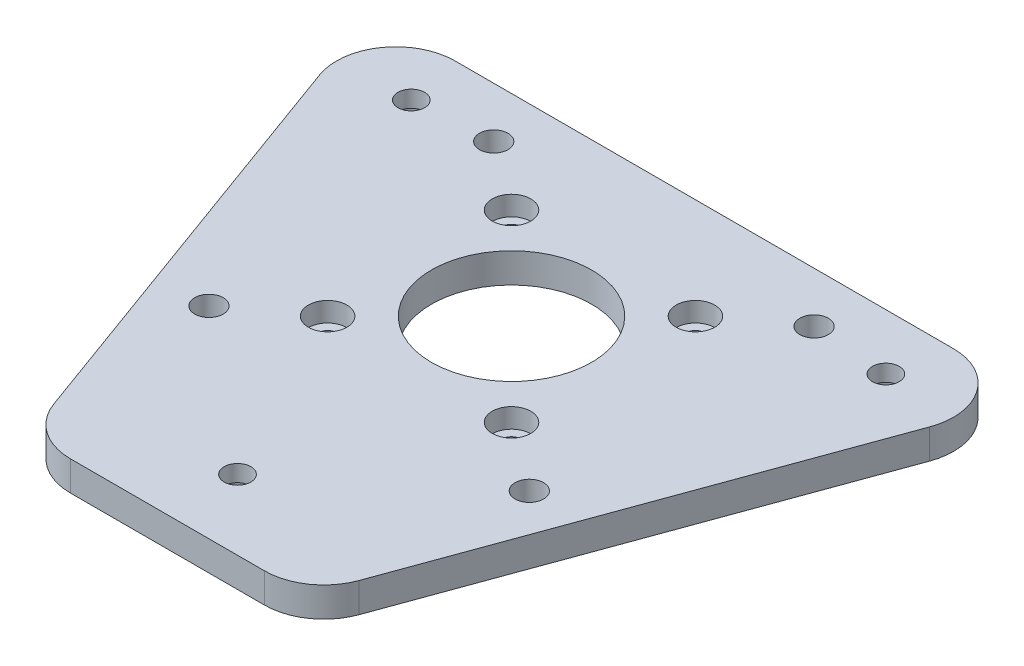
ISO-10303-21;
HEADER;
FILE_DESCRIPTION(('STEP AP214'),'2;1');
FILE_NAME('part.step','',(''),(''),'','','');
FILE_SCHEMA(('AUTOMOTIVE_DESIGN { 1 0 10303 214 1 1 1 1 }'));
ENDSEC;
DATA;
#1=APPLICATION_CONTEXT('core data for automotive mechanical design processes');
#2=APPLICATION_PROTOCOL_DEFINITION('international standard','automotive_design',2000,#1);
#3=PRODUCT_CONTEXT('',#1,'mechanical');
#4=PRODUCT('Part','Part','',(#3));
#5=PRODUCT_RELATED_PRODUCT_CATEGORY('part','',(#4));
#6=PRODUCT_DEFINITION_FORMATION('','',#4);
#7=PRODUCT_DEFINITION_CONTEXT('part definition',#1,'design');
#8=PRODUCT_DEFINITION('design','',#6,#7);
#9=PRODUCT_DEFINITION_SHAPE('','',#8);
#10=(LENGTH_UNIT() NAMED_UNIT(*) SI_UNIT(.MILLI.,.METRE.));
#11=(NAMED_UNIT(*) PLANE_ANGLE_UNIT() SI_UNIT($,.RADIAN.));
#12=(NAMED_UNIT(*) SI_UNIT($,.STERADIAN.) SOLID_ANGLE_UNIT());
#13=UNCERTAINTY_MEASURE_WITH_UNIT(LENGTH_MEASURE(1.E-05),#10,'distance_accuracy_value','');
#14=(GEOMETRIC_REPRESENTATION_CONTEXT(3) GLOBAL_UNCERTAINTY_ASSIGNED_CONTEXT((#13)) GLOBAL_UNIT_ASSIGNED_CONTEXT((#10,
#11,#12)) REPRESENTATION_CONTEXT('',''));
#15=CARTESIAN_POINT('',(0.,0.,0.));
#16=DIRECTION('',(0.,0.,1.));
#17=DIRECTION('',(1.,0.,0.));
#18=AXIS2_PLACEMENT_3D('',#15,#16,#17);
#19=CARTESIAN_POINT('',(0.,5.,0.));
#20=DIRECTION('',(0.,-1.,0.));
#21=DIRECTION('',(0.,0.,-1.));
#22=AXIS2_PLACEMENT_3D('',#19,#20,#21);
#23=PLANE('',#22);
#24=CARTESIAN_POINT('',(0.,5.,46.19));
#25=DIRECTION('',(0.,-1.,0.));
#26=DIRECTION('',(0.,0.,-1.));
#27=AXIS2_PLACEMENT_3D('',#24,#25,#26);
#28=CIRCLE('',#27,2.25);
#29=CARTESIAN_POINT('',(0.,5.,43.94));
#30=VERTEX_POINT('',#29);
#31=EDGE_CURVE('E288',#30,#30,#28,.T.);
#32=ORIENTED_EDGE('',*,*,#31,.T.);
#33=EDGE_LOOP('',(#32));
#34=FACE_BOUND('',#33,.T.);
#35=CARTESIAN_POINT('',(-40.,5.,-23.1));
#36=DIRECTION('',(0.,-1.,0.));
#37=DIRECTION('',(0.,0.,-1.));
#38=AXIS2_PLACEMENT_3D('',#35,#36,#37);
#39=CIRCLE('',#38,2.25);
#40=CARTESIAN_POINT('',(-40.,5.,-25.35));
#41=VERTEX_POINT('',#40);
#42=EDGE_CURVE('E276',#41,#41,#39,.T.);
#43=ORIENTED_EDGE('',*,*,#42,.T.);
#44=EDGE_LOOP('',(#43));
#45=FACE_BOUND('',#44,.T.);
#46=CARTESIAN_POINT('',(40.,5.,-23.1));
#47=DIRECTION('',(0.,-1.,0.));
#48=DIRECTION('',(0.,0.,-1.));
#49=AXIS2_PLACEMENT_3D('',#46,#47,#48);
#50=CIRCLE('',#49,2.25);
#51=CARTESIAN_POINT('',(40.,5.,-25.35));
#52=VERTEX_POINT('',#51);
#53=EDGE_CURVE('E264',#52,#52,#50,.T.);
#54=ORIENTED_EDGE('',*,*,#53,.T.);
#55=EDGE_LOOP('',(#54));
#56=FACE_BOUND('',#55,.T.);
#57=CARTESIAN_POINT('',(-15.5,5.,-15.5));
#58=DIRECTION('',(0.,1.,0.));
#59=DIRECTION('',(0.,0.,1.));
#60=AXIS2_PLACEMENT_3D('',#57,#58,#59);
#61=CIRCLE('',#60,3.25);
#62=CARTESIAN_POINT('',(-15.5,5.,-12.25));
#63=VERTEX_POINT('',#62);
#64=EDGE_CURVE('E261',#63,#63,#61,.T.);
#65=ORIENTED_EDGE('',*,*,#64,.F.);
#66=EDGE_LOOP('',(#65));
#67=FACE_BOUND('',#66,.T.);
#68=CARTESIAN_POINT('',(15.5,5.,-15.5));
#69=DIRECTION('',(0.,1.,0.));
#70=DIRECTION('',(0.,0.,1.));
#71=AXIS2_PLACEMENT_3D('',#68,#69,#70);
#72=CIRCLE('',#71,3.25);
#73=CARTESIAN_POINT('',(15.5,5.,-12.25));
#74=VERTEX_POINT('',#73);
#75=EDGE_CURVE('E249',#74,#74,#72,.T.);
#76=ORIENTED_EDGE('',*,*,#75,.F.);
#77=EDGE_LOOP('',(#76));
#78=FACE_BOUND('',#77,.T.);
#79=CARTESIAN_POINT('',(15.5,5.,15.5));
#80=DIRECTION('',(0.,1.,0.));
#81=DIRECTION('',(0.,0.,1.));
#82=AXIS2_PLACEMENT_3D('',#79,#80,#81);
#83=CIRCLE('',#82,3.25);
#84=CARTESIAN_POINT('',(15.5,5.,18.75));
#85=VERTEX_POINT('',#84);
#86=EDGE_CURVE('E237',#85,#85,#83,.T.);
#87=ORIENTED_EDGE('',*,*,#86,.F.);
#88=EDGE_LOOP('',(#87));
#89=FACE_BOUND('',#88,.T.);
#90=CARTESIAN_POINT('',(-15.5,5.,15.5));
#91=DIRECTION('',(0.,1.,0.));
#92=DIRECTION('',(0.,0.,1.));
#93=AXIS2_PLACEMENT_3D('',#90,#91,#92);
#94=CIRCLE('',#93,3.25);
#95=CARTESIAN_POINT('',(-15.5,5.,18.75));
#96=VERTEX_POINT('',#95);
#97=EDGE_CURVE('E225',#96,#96,#94,.T.);
#98=ORIENTED_EDGE('',*,*,#97,.F.);
#99=EDGE_LOOP('',(#98));
#100=FACE_BOUND('',#99,.T.);
#101=CARTESIAN_POINT('',(0.,5.,0.));
#102=DIRECTION('',(0.,1.,0.));
#103=DIRECTION('',(0.,0.,1.));
#104=AXIS2_PLACEMENT_3D('',#101,#102,#103);
#105=CIRCLE('',#104,13.5);
#106=CARTESIAN_POINT('',(0.,5.,13.5));
#107=VERTEX_POINT('',#106);
#108=EDGE_CURVE('E50',#107,#107,#105,.T.);
#109=ORIENTED_EDGE('',*,*,#108,.F.);
#110=EDGE_LOOP('',(#109));
#111=FACE_BOUND('',#110,.T.);
#112=CARTESIAN_POINT('',(-16.3480951115046,5.,48.));
#113=DIRECTION('',(0.,1.,0.));
#114=DIRECTION('',(0.,0.,1.));
#115=AXIS2_PLACEMENT_3D('',#112,#113,#114);
#116=CIRCLE('',#115,10.);
#117=CARTESIAN_POINT('',(-25.7449430600682,5.,51.4204164412504));
#118=VERTEX_POINT('',#117);
#119=CARTESIAN_POINT('',(-16.3480951115045,5.,58.));
#120=VERTEX_POINT('',#119);
#121=EDGE_CURVE('E147',#118,#120,#116,.T.);
#122=ORIENTED_EDGE('',*,*,#121,.T.);
#123=DIRECTION('',(1.,0.,0.));
#124=VECTOR('',#123,1.);
#125=CARTESIAN_POINT('',(-16.3480951115045,5.,58.));
#126=LINE('',#125,#124);
#127=CARTESIAN_POINT('',(16.3480951115045,5.,58.));
#128=VERTEX_POINT('',#127);
#129=EDGE_CURVE('E150',#120,#128,#126,.T.);
#130=ORIENTED_EDGE('',*,*,#129,.T.);
#131=CARTESIAN_POINT('',(16.3480951115046,5.,48.));
#132=DIRECTION('',(0.,1.,0.));
#133=DIRECTION('',(0.,0.,-1.));
#134=AXIS2_PLACEMENT_3D('',#131,#132,#133);
#135=CIRCLE('',#134,10.);
#136=CARTESIAN_POINT('',(25.7449430600682,5.,51.4204164412504));
#137=VERTEX_POINT('',#136);
#138=EDGE_CURVE('E61',#128,#137,#135,.T.);
#139=ORIENTED_EDGE('',*,*,#138,.T.);
#140=DIRECTION('',(0.342041644125043,0.,-0.939684794856359));
#141=VECTOR('',#140,1.);
#142=CARTESIAN_POINT('',(51.4066713787663,5.,-19.0795835587496));
#143=LINE('',#142,#141);
#144=CARTESIAN_POINT('',(51.4066713787663,5.,-19.0795835587496));
#145=VERTEX_POINT('',#144);
#146=EDGE_CURVE('E118',#137,#145,#143,.T.);
#147=ORIENTED_EDGE('',*,*,#146,.T.);
#148=CARTESIAN_POINT('',(42.0098234302028,5.,-22.5000000000001));
#149=DIRECTION('',(0.,1.,0.));
#150=DIRECTION('',(0.,0.,1.));
#151=AXIS2_PLACEMENT_3D('',#148,#149,#150);
#152=CIRCLE('',#151,10.);
#153=CARTESIAN_POINT('',(42.0098234302027,5.,-32.5000000000001));
#154=VERTEX_POINT('',#153);
#155=EDGE_CURVE('E156',#145,#154,#152,.T.);
#156=ORIENTED_EDGE('',*,*,#155,.T.);
#157=DIRECTION('',(-1.,0.,0.));
#158=VECTOR('',#157,1.);
#159=CARTESIAN_POINT('',(-42.0098234302027,5.,-32.5000000000001));
#160=LINE('',#159,#158);
#161=CARTESIAN_POINT('',(-42.0098234302028,5.,-32.5000000000001));
#162=VERTEX_POINT('',#161);
#163=EDGE_CURVE('E159',#154,#162,#160,.T.);
#164=ORIENTED_EDGE('',*,*,#163,.T.);
#165=CARTESIAN_POINT('',(-42.0098234302028,5.,-22.5000000000001));
#166=DIRECTION('',(0.,1.,0.));
#167=DIRECTION('',(0.,0.,-1.));
#168=AXIS2_PLACEMENT_3D('',#165,#166,#167);
#169=CIRCLE('',#168,10.);
#170=CARTESIAN_POINT('',(-51.4066713787663,5.,-19.0795835587496));
#171=VERTEX_POINT('',#170);
#172=EDGE_CURVE('E162',#162,#171,#169,.T.);
#173=ORIENTED_EDGE('',*,*,#172,.T.);
#174=DIRECTION('',(0.342041644125043,0.,0.939684794856359));
#175=VECTOR('',#174,1.);
#176=CARTESIAN_POINT('',(-51.4066713787663,5.,-19.0795835587496));
#177=LINE('',#176,#175);
#178=EDGE_CURVE('E165',#171,#118,#177,.T.);
#179=ORIENTED_EDGE('',*,*,#178,.T.);
#180=EDGE_LOOP('',(#122,#130,#139,#147,#156,#164,#173,#179));
#181=FACE_BOUND('',#180,.T.);
#182=CARTESIAN_POINT('',(-27.,5.,24.));
#183=DIRECTION('',(0.,1.,0.));
#184=DIRECTION('',(0.,0.,1.));
#185=AXIS2_PLACEMENT_3D('',#182,#183,#184);
#186=CIRCLE('',#185,2.4);
#187=CARTESIAN_POINT('',(-27.,5.,26.4));
#188=VERTEX_POINT('',#187);
#189=EDGE_CURVE('E195',#188,#188,#186,.T.);
#190=ORIENTED_EDGE('',*,*,#189,.F.);
#191=EDGE_LOOP('',(#190));
#192=FACE_BOUND('',#191,.T.);
#193=CARTESIAN_POINT('',(27.,5.,24.));
#194=DIRECTION('',(0.,1.,0.));
#195=DIRECTION('',(0.,0.,1.));
#196=AXIS2_PLACEMENT_3D('',#193,#194,#195);
#197=CIRCLE('',#196,2.4);
#198=CARTESIAN_POINT('',(27.,5.,26.4));
#199=VERTEX_POINT('',#198);
#200=EDGE_CURVE('E201',#199,#199,#197,.T.);
#201=ORIENTED_EDGE('',*,*,#200,.F.);
#202=EDGE_LOOP('',(#201));
#203=FACE_BOUND('',#202,.T.);
#204=CARTESIAN_POINT('',(27.,5.,-24.0000000000001));
#205=DIRECTION('',(0.,1.,0.));
#206=DIRECTION('',(0.,0.,1.));
#207=AXIS2_PLACEMENT_3D('',#204,#205,#206);
#208=CIRCLE('',#207,2.4);
#209=CARTESIAN_POINT('',(27.,5.,-21.6000000000001));
#210=VERTEX_POINT('',#209);
#211=EDGE_CURVE('E207',#210,#210,#208,.T.);
#212=ORIENTED_EDGE('',*,*,#211,.F.);
#213=EDGE_LOOP('',(#212));
#214=FACE_BOUND('',#213,.T.);
#215=CARTESIAN_POINT('',(-27.,5.,-24.0000000000001));
#216=DIRECTION('',(0.,1.,0.));
#217=DIRECTION('',(0.,0.,1.));
#218=AXIS2_PLACEMENT_3D('',#215,#216,#217);
#219=CIRCLE('',#218,2.4);
#220=CARTESIAN_POINT('',(-27.,5.,-21.6000000000001));
#221=VERTEX_POINT('',#220);
#222=EDGE_CURVE('E213',#221,#221,#219,.T.);
#223=ORIENTED_EDGE('',*,*,#222,.F.);
#224=EDGE_LOOP('',(#223));
#225=FACE_BOUND('',#224,.T.);
#226=ADVANCED_FACE('F46',(#34,#45,#56,#67,#78,#89,#100,#111,#181,#192,#203,#214,#225),#23,.F.);
#227=CARTESIAN_POINT('',(0.,0.,0.));
#228=DIRECTION('',(0.,-1.,0.));
#229=DIRECTION('',(0.,0.,-1.));
#230=AXIS2_PLACEMENT_3D('',#227,#228,#229);
#231=PLANE('',#230);
#232=CARTESIAN_POINT('',(0.,0.,46.19));
#233=DIRECTION('',(0.,-1.,0.));
#234=DIRECTION('',(0.,0.,-1.));
#235=AXIS2_PLACEMENT_3D('',#232,#233,#234);
#236=CIRCLE('',#235,4.3);
#237=CARTESIAN_POINT('',(0.,0.,41.89));
#238=VERTEX_POINT('',#237);
#239=EDGE_CURVE('E297',#238,#238,#236,.T.);
#240=ORIENTED_EDGE('',*,*,#239,.F.);
#241=EDGE_LOOP('',(#240));
#242=FACE_BOUND('',#241,.T.);
#243=CARTESIAN_POINT('',(-40.,0.,-23.1));
#244=DIRECTION('',(0.,-1.,0.));
#245=DIRECTION('',(0.,0.,-1.));
#246=AXIS2_PLACEMENT_3D('',#243,#244,#245);
#247=CIRCLE('',#246,4.3);
#248=CARTESIAN_POINT('',(-40.,0.,-27.4));
#249=VERTEX_POINT('',#248);
#250=EDGE_CURVE('E285',#249,#249,#247,.T.);
#251=ORIENTED_EDGE('',*,*,#250,.F.);
#252=EDGE_LOOP('',(#251));
#253=FACE_BOUND('',#252,.T.);
#254=CARTESIAN_POINT('',(40.,0.,-23.1));
#255=DIRECTION('',(0.,-1.,0.));
#256=DIRECTION('',(0.,0.,-1.));
#257=AXIS2_PLACEMENT_3D('',#254,#255,#256);
#258=CIRCLE('',#257,4.3);
#259=CARTESIAN_POINT('',(40.,0.,-27.4));
#260=VERTEX_POINT('',#259);
#261=EDGE_CURVE('E273',#260,#260,#258,.T.);
#262=ORIENTED_EDGE('',*,*,#261,.F.);
#263=EDGE_LOOP('',(#262));
#264=FACE_BOUND('',#263,.T.);
#265=CARTESIAN_POINT('',(-15.5,0.,-15.5));
#266=DIRECTION('',(0.,-1.,0.));
#267=DIRECTION('',(0.,0.,-1.));
#268=AXIS2_PLACEMENT_3D('',#265,#266,#267);
#269=CIRCLE('',#268,1.7);
#270=CARTESIAN_POINT('',(-15.5,0.,-17.2));
#271=VERTEX_POINT('',#270);
#272=EDGE_CURVE('E252',#271,#271,#269,.T.);
#273=ORIENTED_EDGE('',*,*,#272,.F.);
#274=EDGE_LOOP('',(#273));
#275=FACE_BOUND('',#274,.T.);
#276=CARTESIAN_POINT('',(15.5,0.,-15.5));
#277=DIRECTION('',(0.,-1.,0.));
#278=DIRECTION('',(0.,0.,-1.));
#279=AXIS2_PLACEMENT_3D('',#276,#277,#278);
#280=CIRCLE('',#279,1.7);
#281=CARTESIAN_POINT('',(15.5,0.,-17.2));
#282=VERTEX_POINT('',#281);
#283=EDGE_CURVE('E240',#282,#282,#280,.T.);
#284=ORIENTED_EDGE('',*,*,#283,.F.);
#285=EDGE_LOOP('',(#284));
#286=FACE_BOUND('',#285,.T.);
#287=CARTESIAN_POINT('',(15.5,0.,15.5));
#288=DIRECTION('',(0.,-1.,0.));
#289=DIRECTION('',(0.,0.,-1.));
#290=AXIS2_PLACEMENT_3D('',#287,#288,#289);
#291=CIRCLE('',#290,1.7);
#292=CARTESIAN_POINT('',(15.5,0.,13.8));
#293=VERTEX_POINT('',#292);
#294=EDGE_CURVE('E228',#293,#293,#291,.T.);
#295=ORIENTED_EDGE('',*,*,#294,.F.);
#296=EDGE_LOOP('',(#295));
#297=FACE_BOUND('',#296,.T.);
#298=CARTESIAN_POINT('',(-15.5,0.,15.5));
#299=DIRECTION('',(0.,-1.,0.));
#300=DIRECTION('',(0.,0.,-1.));
#301=AXIS2_PLACEMENT_3D('',#298,#299,#300);
#302=CIRCLE('',#301,1.7);
#303=CARTESIAN_POINT('',(-15.5,0.,13.8));
#304=VERTEX_POINT('',#303);
#305=EDGE_CURVE('E216',#304,#304,#302,.T.);
#306=ORIENTED_EDGE('',*,*,#305,.F.);
#307=EDGE_LOOP('',(#306));
#308=FACE_BOUND('',#307,.T.);
#309=CARTESIAN_POINT('',(-27.,0.,-24.0000000000001));
#310=DIRECTION('',(0.,-1.,0.));
#311=DIRECTION('',(0.,0.,-1.));
#312=AXIS2_PLACEMENT_3D('',#309,#310,#311);
#313=CIRCLE('',#312,2.4);
#314=CARTESIAN_POINT('',(-27.,0.,-26.4000000000001));
#315=VERTEX_POINT('',#314);
#316=EDGE_CURVE('E210',#315,#315,#313,.T.);
#317=ORIENTED_EDGE('',*,*,#316,.F.);
#318=EDGE_LOOP('',(#317));
#319=FACE_BOUND('',#318,.T.);
#320=CARTESIAN_POINT('',(27.,0.,-24.0000000000001));
#321=DIRECTION('',(0.,-1.,0.));
#322=DIRECTION('',(0.,0.,-1.));
#323=AXIS2_PLACEMENT_3D('',#320,#321,#322);
#324=CIRCLE('',#323,2.4);
#325=CARTESIAN_POINT('',(27.,0.,-26.4000000000001));
#326=VERTEX_POINT('',#325);
#327=EDGE_CURVE('E204',#326,#326,#324,.T.);
#328=ORIENTED_EDGE('',*,*,#327,.F.);
#329=EDGE_LOOP('',(#328));
#330=FACE_BOUND('',#329,.T.);
#331=CARTESIAN_POINT('',(27.,0.,24.));
#332=DIRECTION('',(0.,-1.,0.));
#333=DIRECTION('',(0.,0.,-1.));
#334=AXIS2_PLACEMENT_3D('',#331,#332,#333);
#335=CIRCLE('',#334,2.4);
#336=CARTESIAN_POINT('',(27.,0.,21.6));
#337=VERTEX_POINT('',#336);
#338=EDGE_CURVE('E198',#337,#337,#335,.T.);
#339=ORIENTED_EDGE('',*,*,#338,.F.);
#340=EDGE_LOOP('',(#339));
#341=FACE_BOUND('',#340,.T.);
#342=CARTESIAN_POINT('',(-27.,0.,24.));
#343=DIRECTION('',(0.,-1.,0.));
#344=DIRECTION('',(0.,0.,-1.));
#345=AXIS2_PLACEMENT_3D('',#342,#343,#344);
#346=CIRCLE('',#345,2.4);
#347=CARTESIAN_POINT('',(-27.,0.,21.6));
#348=VERTEX_POINT('',#347);
#349=EDGE_CURVE('E151',#348,#348,#346,.T.);
#350=ORIENTED_EDGE('',*,*,#349,.F.);
#351=EDGE_LOOP('',(#350));
#352=FACE_BOUND('',#351,.T.);
#353=CARTESIAN_POINT('',(0.,0.,0.));
#354=DIRECTION('',(0.,1.,0.));
#355=DIRECTION('',(0.,0.,1.));
#356=AXIS2_PLACEMENT_3D('',#353,#354,#355);
#357=CIRCLE('',#356,13.5);
#358=CARTESIAN_POINT('',(0.,0.,13.5));
#359=VERTEX_POINT('',#358);
#360=EDGE_CURVE('E13',#359,#359,#357,.T.);
#361=ORIENTED_EDGE('',*,*,#360,.T.);
#362=EDGE_LOOP('',(#361));
#363=FACE_BOUND('',#362,.T.);
#364=DIRECTION('',(1.,0.,0.));
#365=VECTOR('',#364,1.);
#366=CARTESIAN_POINT('',(-16.3480951115045,0.,58.));
#367=LINE('',#366,#365);
#368=CARTESIAN_POINT('',(-16.3480951115045,0.,58.));
#369=VERTEX_POINT('',#368);
#370=CARTESIAN_POINT('',(16.3480951115045,0.,58.));
#371=VERTEX_POINT('',#370);
#372=EDGE_CURVE('E128',#369,#371,#367,.T.);
#373=ORIENTED_EDGE('',*,*,#372,.F.);
#374=CARTESIAN_POINT('',(-16.3480951115046,0.,48.));
#375=DIRECTION('',(0.,1.,0.));
#376=DIRECTION('',(0.,0.,1.));
#377=AXIS2_PLACEMENT_3D('',#374,#375,#376);
#378=CIRCLE('',#377,10.);
#379=CARTESIAN_POINT('',(-25.7449430600682,0.,51.4204164412504));
#380=VERTEX_POINT('',#379);
#381=EDGE_CURVE('E69',#380,#369,#378,.T.);
#382=ORIENTED_EDGE('',*,*,#381,.F.);
#383=DIRECTION('',(0.342041644125043,0.,0.939684794856359));
#384=VECTOR('',#383,1.);
#385=CARTESIAN_POINT('',(-51.4066713787663,0.,-19.0795835587496));
#386=LINE('',#385,#384);
#387=CARTESIAN_POINT('',(-51.4066713787663,0.,-19.0795835587496));
#388=VERTEX_POINT('',#387);
#389=EDGE_CURVE('E143',#388,#380,#386,.T.);
#390=ORIENTED_EDGE('',*,*,#389,.F.);
#391=CARTESIAN_POINT('',(-42.0098234302028,0.,-22.5000000000001));
#392=DIRECTION('',(0.,1.,0.));
#393=DIRECTION('',(0.,0.,-1.));
#394=AXIS2_PLACEMENT_3D('',#391,#392,#393);
#395=CIRCLE('',#394,10.);
#396=CARTESIAN_POINT('',(-42.0098234302028,0.,-32.5000000000001));
#397=VERTEX_POINT('',#396);
#398=EDGE_CURVE('E140',#397,#388,#395,.T.);
#399=ORIENTED_EDGE('',*,*,#398,.F.);
#400=DIRECTION('',(-1.,0.,0.));
#401=VECTOR('',#400,1.);
#402=CARTESIAN_POINT('',(-42.0098234302027,0.,-32.5000000000001));
#403=LINE('',#402,#401);
#404=CARTESIAN_POINT('',(42.0098234302027,0.,-32.5000000000001));
#405=VERTEX_POINT('',#404);
#406=EDGE_CURVE('E134',#405,#397,#403,.T.);
#407=ORIENTED_EDGE('',*,*,#406,.F.);
#408=CARTESIAN_POINT('',(42.0098234302028,0.,-22.5000000000001));
#409=DIRECTION('',(0.,1.,0.));
#410=DIRECTION('',(0.,0.,1.));
#411=AXIS2_PLACEMENT_3D('',#408,#409,#410);
#412=CIRCLE('',#411,10.);
#413=CARTESIAN_POINT('',(51.4066713787663,0.,-19.0795835587496));
#414=VERTEX_POINT('',#413);
#415=EDGE_CURVE('E132',#414,#405,#412,.T.);
#416=ORIENTED_EDGE('',*,*,#415,.F.);
#417=DIRECTION('',(0.342041644125043,0.,-0.939684794856359));
#418=VECTOR('',#417,1.);
#419=CARTESIAN_POINT('',(51.4066713787663,0.,-19.0795835587496));
#420=LINE('',#419,#418);
#421=CARTESIAN_POINT('',(25.7449430600682,0.,51.4204164412504));
#422=VERTEX_POINT('',#421);
#423=EDGE_CURVE('E115',#422,#414,#420,.T.);
#424=ORIENTED_EDGE('',*,*,#423,.F.);
#425=CARTESIAN_POINT('',(16.3480951115046,0.,48.));
#426=DIRECTION('',(0.,1.,0.));
#427=DIRECTION('',(0.,0.,-1.));
#428=AXIS2_PLACEMENT_3D('',#425,#426,#427);
#429=CIRCLE('',#428,10.);
#430=EDGE_CURVE('E123',#371,#422,#429,.T.);
#431=ORIENTED_EDGE('',*,*,#430,.F.);
#432=EDGE_LOOP('',(#373,#382,#390,#399,#407,#416,#424,#431));
#433=FACE_BOUND('',#432,.T.);
#434=ADVANCED_FACE('F48',(#242,#253,#264,#275,#286,#297,#308,#319,#330,#341,#352,#363,#433),
#231,.T.);
#435=CARTESIAN_POINT('',(0.,0.,0.));
#436=DIRECTION('',(0.,1.,0.));
#437=DIRECTION('',(0.,0.,1.));
#438=AXIS2_PLACEMENT_3D('',#435,#436,#437);
#439=CYLINDRICAL_SURFACE('',#438,13.5);
#440=ORIENTED_EDGE('',*,*,#360,.F.);
#441=EDGE_LOOP('',(#440));
#442=FACE_BOUND('',#441,.T.);
#443=ORIENTED_EDGE('',*,*,#108,.T.);
#444=EDGE_LOOP('',(#443));
#445=FACE_BOUND('',#444,.T.);
#446=ADVANCED_FACE('F305',(#442,#445),#439,.F.);
#447=CARTESIAN_POINT('',(-16.3480951115046,0.,48.));
#448=DIRECTION('',(0.,1.,0.));
#449=DIRECTION('',(0.,0.,1.));
#450=AXIS2_PLACEMENT_3D('',#447,#448,#449);
#451=CYLINDRICAL_SURFACE('',#450,10.);
#452=ORIENTED_EDGE('',*,*,#121,.F.);
#453=DIRECTION('',(0.,1.,0.));
#454=VECTOR('',#453,1.);
#455=CARTESIAN_POINT('',(-25.7449430600682,0.,51.4204164412504));
#456=LINE('',#455,#454);
#457=EDGE_CURVE('E168',#380,#118,#456,.T.);
#458=ORIENTED_EDGE('',*,*,#457,.F.);
#459=ORIENTED_EDGE('',*,*,#381,.T.);
#460=DIRECTION('',(0.,1.,0.));
#461=VECTOR('',#460,1.);
#462=CARTESIAN_POINT('',(-16.3480951115045,0.,58.));
#463=LINE('',#462,#461);
#464=EDGE_CURVE('E146',#369,#120,#463,.T.);
#465=ORIENTED_EDGE('',*,*,#464,.T.);
#466=EDGE_LOOP('',(#452,#458,#459,#465));
#467=FACE_BOUND('',#466,.T.);
#468=ADVANCED_FACE('F180',(#467),#451,.T.);
#469=CARTESIAN_POINT('',(-51.4066713787663,0.,-19.0795835587496));
#470=DIRECTION('',(-0.939684794856359,0.,0.342041644125043));
#471=DIRECTION('',(0.342041644125043,0.,0.939684794856359));
#472=AXIS2_PLACEMENT_3D('',#469,#470,#471);
#473=PLANE('',#472);
#474=ORIENTED_EDGE('',*,*,#178,.F.);
#475=DIRECTION('',(0.,1.,0.));
#476=VECTOR('',#475,1.);
#477=CARTESIAN_POINT('',(-51.4066713787663,0.,-19.0795835587496));
#478=LINE('',#477,#476);
#479=EDGE_CURVE('E170',#388,#171,#478,.T.);
#480=ORIENTED_EDGE('',*,*,#479,.F.);
#481=ORIENTED_EDGE('',*,*,#389,.T.);
#482=ORIENTED_EDGE('',*,*,#457,.T.);
#483=EDGE_LOOP('',(#474,#480,#481,#482));
#484=FACE_BOUND('',#483,.T.);
#485=ADVANCED_FACE('F188',(#484),#473,.T.);
#486=CARTESIAN_POINT('',(-42.0098234302028,0.,-22.5000000000001));
#487=DIRECTION('',(0.,1.,0.));
#488=DIRECTION('',(0.,0.,1.));
#489=AXIS2_PLACEMENT_3D('',#486,#487,#488);
#490=CYLINDRICAL_SURFACE('',#489,10.);
#491=ORIENTED_EDGE('',*,*,#172,.F.);
#492=DIRECTION('',(0.,1.,0.));
#493=VECTOR('',#492,1.);
#494=CARTESIAN_POINT('',(-42.0098234302028,0.,-32.5000000000001));
#495=LINE('',#494,#493);
#496=EDGE_CURVE('E172',#397,#162,#495,.T.);
#497=ORIENTED_EDGE('',*,*,#496,.F.);
#498=ORIENTED_EDGE('',*,*,#398,.T.);
#499=ORIENTED_EDGE('',*,*,#479,.T.);
#500=EDGE_LOOP('',(#491,#497,#498,#499));
#501=FACE_BOUND('',#500,.T.);
#502=ADVANCED_FACE('F356',(#501),#490,.T.);
#503=CARTESIAN_POINT('',(-42.0098234302027,0.,-32.5000000000001));
#504=DIRECTION('',(0.,0.,-1.));
#505=DIRECTION('',(-1.,0.,0.));
#506=AXIS2_PLACEMENT_3D('',#503,#504,#505);
#507=PLANE('',#506);
#508=ORIENTED_EDGE('',*,*,#163,.F.);
#509=DIRECTION('',(0.,1.,0.));
#510=VECTOR('',#509,1.);
#511=CARTESIAN_POINT('',(42.0098234302027,0.,-32.5000000000001));
#512=LINE('',#511,#510);
#513=EDGE_CURVE('E174',#405,#154,#512,.T.);
#514=ORIENTED_EDGE('',*,*,#513,.F.);
#515=ORIENTED_EDGE('',*,*,#406,.T.);
#516=ORIENTED_EDGE('',*,*,#496,.T.);
#517=EDGE_LOOP('',(#508,#514,#515,#516));
#518=FACE_BOUND('',#517,.T.);
#519=ADVANCED_FACE('F352',(#518),#507,.T.);
#520=CARTESIAN_POINT('',(42.0098234302028,0.,-22.5000000000001));
#521=DIRECTION('',(0.,1.,0.));
#522=DIRECTION('',(0.,0.,1.));
#523=AXIS2_PLACEMENT_3D('',#520,#521,#522);
#524=CYLINDRICAL_SURFACE('',#523,10.);
#525=ORIENTED_EDGE('',*,*,#155,.F.);
#526=DIRECTION('',(0.,1.,0.));
#527=VECTOR('',#526,1.);
#528=CARTESIAN_POINT('',(51.4066713787663,0.,-19.0795835587496));
#529=LINE('',#528,#527);
#530=EDGE_CURVE('E119',#414,#145,#529,.T.);
#531=ORIENTED_EDGE('',*,*,#530,.F.);
#532=ORIENTED_EDGE('',*,*,#415,.T.);
#533=ORIENTED_EDGE('',*,*,#513,.T.);
#534=EDGE_LOOP('',(#525,#531,#532,#533));
#535=FACE_BOUND('',#534,.T.);
#536=ADVANCED_FACE('F349',(#535),#524,.T.);
#537=CARTESIAN_POINT('',(51.4066713787663,0.,-19.0795835587496));
#538=DIRECTION('',(0.939684794856359,0.,0.342041644125043));
#539=DIRECTION('',(0.342041644125043,0.,-0.939684794856359));
#540=AXIS2_PLACEMENT_3D('',#537,#538,#539);
#541=PLANE('',#540);
#542=ORIENTED_EDGE('',*,*,#146,.F.);
#543=DIRECTION('',(0.,1.,0.));
#544=VECTOR('',#543,1.);
#545=CARTESIAN_POINT('',(25.7449430600682,0.,51.4204164412504));
#546=LINE('',#545,#544);
#547=EDGE_CURVE('E111',#422,#137,#546,.T.);
#548=ORIENTED_EDGE('',*,*,#547,.F.);
#549=ORIENTED_EDGE('',*,*,#423,.T.);
#550=ORIENTED_EDGE('',*,*,#530,.T.);
#551=EDGE_LOOP('',(#542,#548,#549,#550));
#552=FACE_BOUND('',#551,.T.);
#553=ADVANCED_FACE('F113',(#552),#541,.T.);
#554=CARTESIAN_POINT('',(16.3480951115046,0.,48.));
#555=DIRECTION('',(0.,1.,0.));
#556=DIRECTION('',(0.,0.,1.));
#557=AXIS2_PLACEMENT_3D('',#554,#555,#556);
#558=CYLINDRICAL_SURFACE('',#557,10.);
#559=ORIENTED_EDGE('',*,*,#138,.F.);
#560=DIRECTION('',(0.,1.,0.));
#561=VECTOR('',#560,1.);
#562=CARTESIAN_POINT('',(16.3480951115045,0.,58.));
#563=LINE('',#562,#561);
#564=EDGE_CURVE('E120',#371,#128,#563,.T.);
#565=ORIENTED_EDGE('',*,*,#564,.F.);
#566=ORIENTED_EDGE('',*,*,#430,.T.);
#567=ORIENTED_EDGE('',*,*,#547,.T.);
#568=EDGE_LOOP('',(#559,#565,#566,#567));
#569=FACE_BOUND('',#568,.T.);
#570=ADVANCED_FACE('F124',(#569),#558,.T.);
#571=CARTESIAN_POINT('',(-16.3480951115045,0.,58.));
#572=DIRECTION('',(0.,0.,1.));
#573=DIRECTION('',(1.,0.,0.));
#574=AXIS2_PLACEMENT_3D('',#571,#572,#573);
#575=PLANE('',#574);
#576=ORIENTED_EDGE('',*,*,#129,.F.);
#577=ORIENTED_EDGE('',*,*,#464,.F.);
#578=ORIENTED_EDGE('',*,*,#372,.T.);
#579=ORIENTED_EDGE('',*,*,#564,.T.);
#580=EDGE_LOOP('',(#576,#577,#578,#579));
#581=FACE_BOUND('',#580,.T.);
#582=ADVANCED_FACE('F182',(#581),#575,.T.);
#583=CARTESIAN_POINT('',(-27.,5.,24.));
#584=DIRECTION('',(0.,1.,0.));
#585=DIRECTION('',(0.,0.,1.));
#586=AXIS2_PLACEMENT_3D('',#583,#584,#585);
#587=CYLINDRICAL_SURFACE('',#586,2.4);
#588=ORIENTED_EDGE('',*,*,#189,.T.);
#589=EDGE_LOOP('',(#588));
#590=FACE_BOUND('',#589,.T.);
#591=ORIENTED_EDGE('',*,*,#349,.T.);
#592=EDGE_LOOP('',(#591));
#593=FACE_BOUND('',#592,.T.);
#594=ADVANCED_FACE('F344',(#590,#593),#587,.F.);
#595=CARTESIAN_POINT('',(27.,5.,24.));
#596=DIRECTION('',(0.,1.,0.));
#597=DIRECTION('',(0.,0.,1.));
#598=AXIS2_PLACEMENT_3D('',#595,#596,#597);
#599=CYLINDRICAL_SURFACE('',#598,2.4);
#600=ORIENTED_EDGE('',*,*,#200,.T.);
#601=EDGE_LOOP('',(#600));
#602=FACE_BOUND('',#601,.T.);
#603=ORIENTED_EDGE('',*,*,#338,.T.);
#604=EDGE_LOOP('',(#603));
#605=FACE_BOUND('',#604,.T.);
#606=ADVANCED_FACE('F365',(#602,#605),#599,.F.);
#607=CARTESIAN_POINT('',(27.,5.,-24.0000000000001));
#608=DIRECTION('',(0.,1.,0.));
#609=DIRECTION('',(0.,0.,1.));
#610=AXIS2_PLACEMENT_3D('',#607,#608,#609);
#611=CYLINDRICAL_SURFACE('',#610,2.4);
#612=ORIENTED_EDGE('',*,*,#211,.T.);
#613=EDGE_LOOP('',(#612));
#614=FACE_BOUND('',#613,.T.);
#615=ORIENTED_EDGE('',*,*,#327,.T.);
#616=EDGE_LOOP('',(#615));
#617=FACE_BOUND('',#616,.T.);
#618=ADVANCED_FACE('F369',(#614,#617),#611,.F.);
#619=CARTESIAN_POINT('',(-27.,5.,-24.0000000000001));
#620=DIRECTION('',(0.,1.,0.));
#621=DIRECTION('',(0.,0.,1.));
#622=AXIS2_PLACEMENT_3D('',#619,#620,#621);
#623=CYLINDRICAL_SURFACE('',#622,2.4);
#624=ORIENTED_EDGE('',*,*,#222,.T.);
#625=EDGE_LOOP('',(#624));
#626=FACE_BOUND('',#625,.T.);
#627=ORIENTED_EDGE('',*,*,#316,.T.);
#628=EDGE_LOOP('',(#627));
#629=FACE_BOUND('',#628,.T.);
#630=ADVANCED_FACE('F373',(#626,#629),#623,.F.);
#631=CARTESIAN_POINT('',(-15.5,5.,15.5));
#632=DIRECTION('',(0.,1.,0.));
#633=DIRECTION('',(0.,0.,1.));
#634=AXIS2_PLACEMENT_3D('',#631,#632,#633);
#635=CYLINDRICAL_SURFACE('',#634,1.7);
#636=CARTESIAN_POINT('',(-15.5,1.7,15.5));
#637=DIRECTION('',(0.,1.,0.));
#638=DIRECTION('',(0.,0.,1.));
#639=AXIS2_PLACEMENT_3D('',#636,#637,#638);
#640=CIRCLE('',#639,1.7);
#641=CARTESIAN_POINT('',(-15.5,1.7,17.2));
#642=VERTEX_POINT('',#641);
#643=EDGE_CURVE('E219',#642,#642,#640,.T.);
#644=ORIENTED_EDGE('',*,*,#643,.T.);
#645=EDGE_LOOP('',(#644));
#646=FACE_BOUND('',#645,.T.);
#647=ORIENTED_EDGE('',*,*,#305,.T.);
#648=EDGE_LOOP('',(#647));
#649=FACE_BOUND('',#648,.T.);
#650=ADVANCED_FACE('F377',(#646,#649),#635,.F.);
#651=CARTESIAN_POINT('',(-13.8,1.7,15.5));
#652=DIRECTION('',(0.,-1.,0.));
#653=DIRECTION('',(0.,0.,-1.));
#654=AXIS2_PLACEMENT_3D('',#651,#652,#653);
#655=PLANE('',#654);
#656=ORIENTED_EDGE('',*,*,#643,.F.);
#657=EDGE_LOOP('',(#656));
#658=FACE_BOUND('',#657,.T.);
#659=CARTESIAN_POINT('',(-15.5,1.7,15.5));
#660=DIRECTION('',(0.,1.,0.));
#661=DIRECTION('',(0.,0.,1.));
#662=AXIS2_PLACEMENT_3D('',#659,#660,#661);
#663=CIRCLE('',#662,3.25);
#664=CARTESIAN_POINT('',(-15.5,1.7,18.75));
#665=VERTEX_POINT('',#664);
#666=EDGE_CURVE('E222',#665,#665,#663,.T.);
#667=ORIENTED_EDGE('',*,*,#666,.T.);
#668=EDGE_LOOP('',(#667));
#669=FACE_BOUND('',#668,.T.);
#670=ADVANCED_FACE('F381',(#658,#669),#655,.F.);
#671=CARTESIAN_POINT('',(-15.5,5.,15.5));
#672=DIRECTION('',(0.,1.,0.));
#673=DIRECTION('',(0.,0.,1.));
#674=AXIS2_PLACEMENT_3D('',#671,#672,#673);
#675=CYLINDRICAL_SURFACE('',#674,3.25);
#676=ORIENTED_EDGE('',*,*,#666,.F.);
#677=EDGE_LOOP('',(#676));
#678=FACE_BOUND('',#677,.T.);
#679=ORIENTED_EDGE('',*,*,#97,.T.);
#680=EDGE_LOOP('',(#679));
#681=FACE_BOUND('',#680,.T.);
#682=ADVANCED_FACE('F385',(#678,#681),#675,.F.);
#683=CARTESIAN_POINT('',(15.5,5.,15.5));
#684=DIRECTION('',(0.,1.,0.));
#685=DIRECTION('',(0.,0.,1.));
#686=AXIS2_PLACEMENT_3D('',#683,#684,#685);
#687=CYLINDRICAL_SURFACE('',#686,1.7);
#688=CARTESIAN_POINT('',(15.5,1.7,15.5));
#689=DIRECTION('',(0.,1.,0.));
#690=DIRECTION('',(0.,0.,1.));
#691=AXIS2_PLACEMENT_3D('',#688,#689,#690);
#692=CIRCLE('',#691,1.7);
#693=CARTESIAN_POINT('',(15.5,1.7,17.2));
#694=VERTEX_POINT('',#693);
#695=EDGE_CURVE('E231',#694,#694,#692,.T.);
#696=ORIENTED_EDGE('',*,*,#695,.T.);
#697=EDGE_LOOP('',(#696));
#698=FACE_BOUND('',#697,.T.);
#699=ORIENTED_EDGE('',*,*,#294,.T.);
#700=EDGE_LOOP('',(#699));
#701=FACE_BOUND('',#700,.T.);
#702=ADVANCED_FACE('F389',(#698,#701),#687,.F.);
#703=CARTESIAN_POINT('',(17.2,1.7,15.5));
#704=DIRECTION('',(0.,-1.,0.));
#705=DIRECTION('',(0.,0.,-1.));
#706=AXIS2_PLACEMENT_3D('',#703,#704,#705);
#707=PLANE('',#706);
#708=ORIENTED_EDGE('',*,*,#695,.F.);
#709=EDGE_LOOP('',(#708));
#710=FACE_BOUND('',#709,.T.);
#711=CARTESIAN_POINT('',(15.5,1.7,15.5));
#712=DIRECTION('',(0.,1.,0.));
#713=DIRECTION('',(0.,0.,1.));
#714=AXIS2_PLACEMENT_3D('',#711,#712,#713);
#715=CIRCLE('',#714,3.25);
#716=CARTESIAN_POINT('',(15.5,1.7,18.75));
#717=VERTEX_POINT('',#716);
#718=EDGE_CURVE('E234',#717,#717,#715,.T.);
#719=ORIENTED_EDGE('',*,*,#718,.T.);
#720=EDGE_LOOP('',(#719));
#721=FACE_BOUND('',#720,.T.);
#722=ADVANCED_FACE('F393',(#710,#721),#707,.F.);
#723=CARTESIAN_POINT('',(15.5,5.,15.5));
#724=DIRECTION('',(0.,1.,0.));
#725=DIRECTION('',(0.,0.,1.));
#726=AXIS2_PLACEMENT_3D('',#723,#724,#725);
#727=CYLINDRICAL_SURFACE('',#726,3.25);
#728=ORIENTED_EDGE('',*,*,#718,.F.);
#729=EDGE_LOOP('',(#728));
#730=FACE_BOUND('',#729,.T.);
#731=ORIENTED_EDGE('',*,*,#86,.T.);
#732=EDGE_LOOP('',(#731));
#733=FACE_BOUND('',#732,.T.);
#734=ADVANCED_FACE('F397',(#730,#733),#727,.F.);
#735=CARTESIAN_POINT('',(15.5,5.,-15.5));
#736=DIRECTION('',(0.,1.,0.));
#737=DIRECTION('',(0.,0.,1.));
#738=AXIS2_PLACEMENT_3D('',#735,#736,#737);
#739=CYLINDRICAL_SURFACE('',#738,1.7);
#740=CARTESIAN_POINT('',(15.5,1.7,-15.5));
#741=DIRECTION('',(0.,1.,0.));
#742=DIRECTION('',(0.,0.,1.));
#743=AXIS2_PLACEMENT_3D('',#740,#741,#742);
#744=CIRCLE('',#743,1.7);
#745=CARTESIAN_POINT('',(15.5,1.7,-13.8));
#746=VERTEX_POINT('',#745);
#747=EDGE_CURVE('E243',#746,#746,#744,.T.);
#748=ORIENTED_EDGE('',*,*,#747,.T.);
#749=EDGE_LOOP('',(#748));
#750=FACE_BOUND('',#749,.T.);
#751=ORIENTED_EDGE('',*,*,#283,.T.);
#752=EDGE_LOOP('',(#751));
#753=FACE_BOUND('',#752,.T.);
#754=ADVANCED_FACE('F401',(#750,#753),#739,.F.);
#755=CARTESIAN_POINT('',(17.2,1.7,-15.5));
#756=DIRECTION('',(0.,-1.,0.));
#757=DIRECTION('',(0.,0.,-1.));
#758=AXIS2_PLACEMENT_3D('',#755,#756,#757);
#759=PLANE('',#758);
#760=ORIENTED_EDGE('',*,*,#747,.F.);
#761=EDGE_LOOP('',(#760));
#762=FACE_BOUND('',#761,.T.);
#763=CARTESIAN_POINT('',(15.5,1.7,-15.5));
#764=DIRECTION('',(0.,1.,0.));
#765=DIRECTION('',(0.,0.,1.));
#766=AXIS2_PLACEMENT_3D('',#763,#764,#765);
#767=CIRCLE('',#766,3.25);
#768=CARTESIAN_POINT('',(15.5,1.7,-12.25));
#769=VERTEX_POINT('',#768);
#770=EDGE_CURVE('E246',#769,#769,#767,.T.);
#771=ORIENTED_EDGE('',*,*,#770,.T.);
#772=EDGE_LOOP('',(#771));
#773=FACE_BOUND('',#772,.T.);
#774=ADVANCED_FACE('F405',(#762,#773),#759,.F.);
#775=CARTESIAN_POINT('',(15.5,5.,-15.5));
#776=DIRECTION('',(0.,1.,0.));
#777=DIRECTION('',(0.,0.,1.));
#778=AXIS2_PLACEMENT_3D('',#775,#776,#777);
#779=CYLINDRICAL_SURFACE('',#778,3.25);
#780=ORIENTED_EDGE('',*,*,#770,.F.);
#781=EDGE_LOOP('',(#780));
#782=FACE_BOUND('',#781,.T.);
#783=ORIENTED_EDGE('',*,*,#75,.T.);
#784=EDGE_LOOP('',(#783));
#785=FACE_BOUND('',#784,.T.);
#786=ADVANCED_FACE('F409',(#782,#785),#779,.F.);
#787=CARTESIAN_POINT('',(-15.5,5.,-15.5));
#788=DIRECTION('',(0.,1.,0.));
#789=DIRECTION('',(0.,0.,1.));
#790=AXIS2_PLACEMENT_3D('',#787,#788,#789);
#791=CYLINDRICAL_SURFACE('',#790,1.7);
#792=CARTESIAN_POINT('',(-15.5,1.7,-15.5));
#793=DIRECTION('',(0.,1.,0.));
#794=DIRECTION('',(0.,0.,1.));
#795=AXIS2_PLACEMENT_3D('',#792,#793,#794);
#796=CIRCLE('',#795,1.7);
#797=CARTESIAN_POINT('',(-15.5,1.7,-13.8));
#798=VERTEX_POINT('',#797);
#799=EDGE_CURVE('E255',#798,#798,#796,.T.);
#800=ORIENTED_EDGE('',*,*,#799,.T.);
#801=EDGE_LOOP('',(#800));
#802=FACE_BOUND('',#801,.T.);
#803=ORIENTED_EDGE('',*,*,#272,.T.);
#804=EDGE_LOOP('',(#803));
#805=FACE_BOUND('',#804,.T.);
#806=ADVANCED_FACE('F413',(#802,#805),#791,.F.);
#807=CARTESIAN_POINT('',(-13.8,1.7,-15.5));
#808=DIRECTION('',(0.,-1.,0.));
#809=DIRECTION('',(0.,0.,-1.));
#810=AXIS2_PLACEMENT_3D('',#807,#808,#809);
#811=PLANE('',#810);
#812=ORIENTED_EDGE('',*,*,#799,.F.);
#813=EDGE_LOOP('',(#812));
#814=FACE_BOUND('',#813,.T.);
#815=CARTESIAN_POINT('',(-15.5,1.7,-15.5));
#816=DIRECTION('',(0.,1.,0.));
#817=DIRECTION('',(0.,0.,1.));
#818=AXIS2_PLACEMENT_3D('',#815,#816,#817);
#819=CIRCLE('',#818,3.25);
#820=CARTESIAN_POINT('',(-15.5,1.7,-12.25));
#821=VERTEX_POINT('',#820);
#822=EDGE_CURVE('E258',#821,#821,#819,.T.);
#823=ORIENTED_EDGE('',*,*,#822,.T.);
#824=EDGE_LOOP('',(#823));
#825=FACE_BOUND('',#824,.T.);
#826=ADVANCED_FACE('F417',(#814,#825),#811,.F.);
#827=CARTESIAN_POINT('',(-15.5,5.,-15.5));
#828=DIRECTION('',(0.,1.,0.));
#829=DIRECTION('',(0.,0.,1.));
#830=AXIS2_PLACEMENT_3D('',#827,#828,#829);
#831=CYLINDRICAL_SURFACE('',#830,3.25);
#832=ORIENTED_EDGE('',*,*,#822,.F.);
#833=EDGE_LOOP('',(#832));
#834=FACE_BOUND('',#833,.T.);
#835=ORIENTED_EDGE('',*,*,#64,.T.);
#836=EDGE_LOOP('',(#835));
#837=FACE_BOUND('',#836,.T.);
#838=ADVANCED_FACE('F421',(#834,#837),#831,.F.);
#839=CARTESIAN_POINT('',(40.,0.,-23.1));
#840=DIRECTION('',(0.,-1.,0.));
#841=DIRECTION('',(0.,0.,-1.));
#842=AXIS2_PLACEMENT_3D('',#839,#840,#841);
#843=CYLINDRICAL_SURFACE('',#842,2.25);
#844=ORIENTED_EDGE('',*,*,#53,.F.);
#845=EDGE_LOOP('',(#844));
#846=FACE_BOUND('',#845,.T.);
#847=CARTESIAN_POINT('',(40.,2.2,-23.1));
#848=DIRECTION('',(0.,-1.,0.));
#849=DIRECTION('',(0.,0.,-1.));
#850=AXIS2_PLACEMENT_3D('',#847,#848,#849);
#851=CIRCLE('',#850,2.25);
#852=CARTESIAN_POINT('',(40.,2.2,-25.35));
#853=VERTEX_POINT('',#852);
#854=EDGE_CURVE('E267',#853,#853,#851,.T.);
#855=ORIENTED_EDGE('',*,*,#854,.T.);
#856=EDGE_LOOP('',(#855));
#857=FACE_BOUND('',#856,.T.);
#858=ADVANCED_FACE('F425',(#846,#857),#843,.F.);
#859=CARTESIAN_POINT('',(42.25,2.2,-23.1));
#860=DIRECTION('',(0.,1.,0.));
#861=DIRECTION('',(0.,0.,1.));
#862=AXIS2_PLACEMENT_3D('',#859,#860,#861);
#863=PLANE('',#862);
#864=ORIENTED_EDGE('',*,*,#854,.F.);
#865=EDGE_LOOP('',(#864));
#866=FACE_BOUND('',#865,.T.);
#867=CARTESIAN_POINT('',(40.,2.2,-23.1));
#868=DIRECTION('',(0.,-1.,0.));
#869=DIRECTION('',(0.,0.,-1.));
#870=AXIS2_PLACEMENT_3D('',#867,#868,#869);
#871=CIRCLE('',#870,4.3);
#872=CARTESIAN_POINT('',(40.,2.2,-27.4));
#873=VERTEX_POINT('',#872);
#874=EDGE_CURVE('E270',#873,#873,#871,.T.);
#875=ORIENTED_EDGE('',*,*,#874,.T.);
#876=EDGE_LOOP('',(#875));
#877=FACE_BOUND('',#876,.T.);
#878=ADVANCED_FACE('F429',(#866,#877),#863,.F.);
#879=CARTESIAN_POINT('',(40.,0.,-23.1));
#880=DIRECTION('',(0.,-1.,0.));
#881=DIRECTION('',(0.,0.,-1.));
#882=AXIS2_PLACEMENT_3D('',#879,#880,#881);
#883=CYLINDRICAL_SURFACE('',#882,4.3);
#884=ORIENTED_EDGE('',*,*,#874,.F.);
#885=EDGE_LOOP('',(#884));
#886=FACE_BOUND('',#885,.T.);
#887=ORIENTED_EDGE('',*,*,#261,.T.);
#888=EDGE_LOOP('',(#887));
#889=FACE_BOUND('',#888,.T.);
#890=ADVANCED_FACE('F433',(#886,#889),#883,.F.);
#891=CARTESIAN_POINT('',(-40.,0.,-23.1));
#892=DIRECTION('',(0.,-1.,0.));
#893=DIRECTION('',(0.,0.,-1.));
#894=AXIS2_PLACEMENT_3D('',#891,#892,#893);
#895=CYLINDRICAL_SURFACE('',#894,2.25);
#896=ORIENTED_EDGE('',*,*,#42,.F.);
#897=EDGE_LOOP('',(#896));
#898=FACE_BOUND('',#897,.T.);
#899=CARTESIAN_POINT('',(-40.,2.2,-23.1));
#900=DIRECTION('',(0.,-1.,0.));
#901=DIRECTION('',(0.,0.,-1.));
#902=AXIS2_PLACEMENT_3D('',#899,#900,#901);
#903=CIRCLE('',#902,2.25);
#904=CARTESIAN_POINT('',(-40.,2.2,-25.35));
#905=VERTEX_POINT('',#904);
#906=EDGE_CURVE('E279',#905,#905,#903,.T.);
#907=ORIENTED_EDGE('',*,*,#906,.T.);
#908=EDGE_LOOP('',(#907));
#909=FACE_BOUND('',#908,.T.);
#910=ADVANCED_FACE('F437',(#898,#909),#895,.F.);
#911=CARTESIAN_POINT('',(-37.75,2.2,-23.1));
#912=DIRECTION('',(0.,1.,0.));
#913=DIRECTION('',(0.,0.,1.));
#914=AXIS2_PLACEMENT_3D('',#911,#912,#913);
#915=PLANE('',#914);
#916=ORIENTED_EDGE('',*,*,#906,.F.);
#917=EDGE_LOOP('',(#916));
#918=FACE_BOUND('',#917,.T.);
#919=CARTESIAN_POINT('',(-40.,2.2,-23.1));
#920=DIRECTION('',(0.,-1.,0.));
#921=DIRECTION('',(0.,0.,-1.));
#922=AXIS2_PLACEMENT_3D('',#919,#920,#921);
#923=CIRCLE('',#922,4.3);
#924=CARTESIAN_POINT('',(-40.,2.2,-27.4));
#925=VERTEX_POINT('',#924);
#926=EDGE_CURVE('E282',#925,#925,#923,.T.);
#927=ORIENTED_EDGE('',*,*,#926,.T.);
#928=EDGE_LOOP('',(#927));
#929=FACE_BOUND('',#928,.T.);
#930=ADVANCED_FACE('F441',(#918,#929),#915,.F.);
#931=CARTESIAN_POINT('',(-40.,0.,-23.1));
#932=DIRECTION('',(0.,-1.,0.));
#933=DIRECTION('',(0.,0.,-1.));
#934=AXIS2_PLACEMENT_3D('',#931,#932,#933);
#935=CYLINDRICAL_SURFACE('',#934,4.3);
#936=ORIENTED_EDGE('',*,*,#926,.F.);
#937=EDGE_LOOP('',(#936));
#938=FACE_BOUND('',#937,.T.);
#939=ORIENTED_EDGE('',*,*,#250,.T.);
#940=EDGE_LOOP('',(#939));
#941=FACE_BOUND('',#940,.T.);
#942=ADVANCED_FACE('F445',(#938,#941),#935,.F.);
#943=CARTESIAN_POINT('',(0.,0.,46.19));
#944=DIRECTION('',(0.,-1.,0.));
#945=DIRECTION('',(0.,0.,-1.));
#946=AXIS2_PLACEMENT_3D('',#943,#944,#945);
#947=CYLINDRICAL_SURFACE('',#946,2.25);
#948=ORIENTED_EDGE('',*,*,#31,.F.);
#949=EDGE_LOOP('',(#948));
#950=FACE_BOUND('',#949,.T.);
#951=CARTESIAN_POINT('',(0.,2.2,46.19));
#952=DIRECTION('',(0.,-1.,0.));
#953=DIRECTION('',(0.,0.,-1.));
#954=AXIS2_PLACEMENT_3D('',#951,#952,#953);
#955=CIRCLE('',#954,2.25);
#956=CARTESIAN_POINT('',(0.,2.2,43.94));
#957=VERTEX_POINT('',#956);
#958=EDGE_CURVE('E291',#957,#957,#955,.T.);
#959=ORIENTED_EDGE('',*,*,#958,.T.);
#960=EDGE_LOOP('',(#959));
#961=FACE_BOUND('',#960,.T.);
#962=ADVANCED_FACE('F449',(#950,#961),#947,.F.);
#963=CARTESIAN_POINT('',(2.25,2.2,46.19));
#964=DIRECTION('',(0.,1.,0.));
#965=DIRECTION('',(0.,0.,1.));
#966=AXIS2_PLACEMENT_3D('',#963,#964,#965);
#967=PLANE('',#966);
#968=ORIENTED_EDGE('',*,*,#958,.F.);
#969=EDGE_LOOP('',(#968));
#970=FACE_BOUND('',#969,.T.);
#971=CARTESIAN_POINT('',(0.,2.2,46.19));
#972=DIRECTION('',(0.,-1.,0.));
#973=DIRECTION('',(0.,0.,-1.));
#974=AXIS2_PLACEMENT_3D('',#971,#972,#973);
#975=CIRCLE('',#974,4.3);
#976=CARTESIAN_POINT('',(0.,2.2,41.89));
#977=VERTEX_POINT('',#976);
#978=EDGE_CURVE('E294',#977,#977,#975,.T.);
#979=ORIENTED_EDGE('',*,*,#978,.T.);
#980=EDGE_LOOP('',(#979));
#981=FACE_BOUND('',#980,.T.);
#982=ADVANCED_FACE('F453',(#970,#981),#967,.F.);
#983=CARTESIAN_POINT('',(0.,0.,46.19));
#984=DIRECTION('',(0.,-1.,0.));
#985=DIRECTION('',(0.,0.,-1.));
#986=AXIS2_PLACEMENT_3D('',#983,#984,#985);
#987=CYLINDRICAL_SURFACE('',#986,4.3);
#988=ORIENTED_EDGE('',*,*,#978,.F.);
#989=EDGE_LOOP('',(#988));
#990=FACE_BOUND('',#989,.T.);
#991=ORIENTED_EDGE('',*,*,#239,.T.);
#992=EDGE_LOOP('',(#991));
#993=FACE_BOUND('',#992,.T.);
#994=ADVANCED_FACE('F301',(#990,#993),#987,.F.);
#995=CLOSED_SHELL('',(#226,#434,#446,#468,#485,#502,#519,#536,#553,#570,#582,#594,#606,#618,
#630,#650,#670,#682,#702,#722,#734,#754,#774,#786,#806,#826,#838,#858,#878,#890,#910,#930,#942,
#962,#982,#994));
#996=MANIFOLD_SOLID_BREP('B2',#995);
#997=ADVANCED_BREP_SHAPE_REPRESENTATION('',(#18,#996),#14);
#998=SHAPE_DEFINITION_REPRESENTATION(#9,#997);
ENDSEC;
END-ISO-10303-21;
